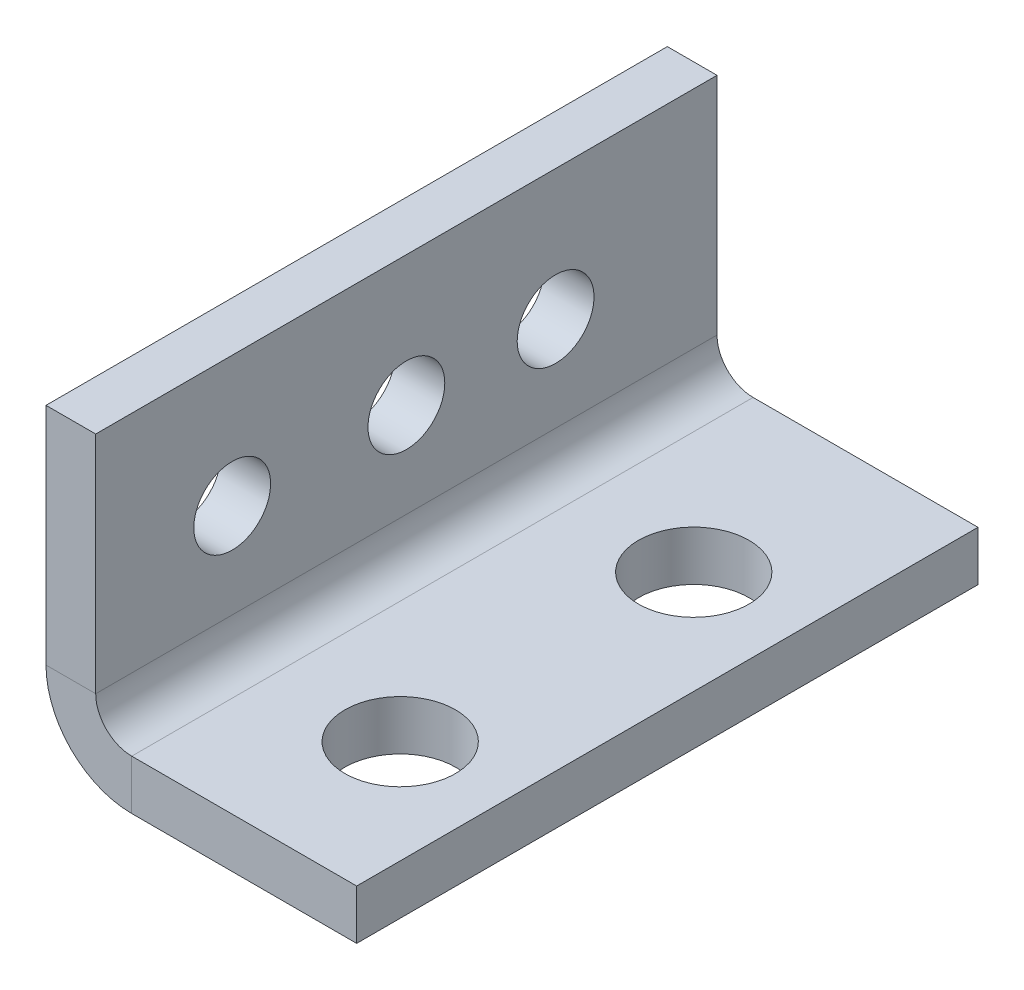
ISO-10303-21;
HEADER;
FILE_DESCRIPTION(('STEP AP214'),'2;1');
FILE_NAME('part.step','',(''),(''),'','','');
FILE_SCHEMA(('AUTOMOTIVE_DESIGN { 1 0 10303 214 1 1 1 1 }'));
ENDSEC;
DATA;
#1=APPLICATION_CONTEXT('core data for automotive mechanical design processes');
#2=APPLICATION_PROTOCOL_DEFINITION('international standard','automotive_design',2000,#1);
#3=PRODUCT_CONTEXT('',#1,'mechanical');
#4=PRODUCT('Part','Part','',(#3));
#5=PRODUCT_RELATED_PRODUCT_CATEGORY('part','',(#4));
#6=PRODUCT_DEFINITION_FORMATION('','',#4);
#7=PRODUCT_DEFINITION_CONTEXT('part definition',#1,'design');
#8=PRODUCT_DEFINITION('design','',#6,#7);
#9=PRODUCT_DEFINITION_SHAPE('','',#8);
#10=(LENGTH_UNIT() NAMED_UNIT(*) SI_UNIT(.MILLI.,.METRE.));
#11=(NAMED_UNIT(*) PLANE_ANGLE_UNIT() SI_UNIT($,.RADIAN.));
#12=(NAMED_UNIT(*) SI_UNIT($,.STERADIAN.) SOLID_ANGLE_UNIT());
#13=UNCERTAINTY_MEASURE_WITH_UNIT(LENGTH_MEASURE(1.E-05),#10,'distance_accuracy_value','');
#14=(GEOMETRIC_REPRESENTATION_CONTEXT(3) GLOBAL_UNCERTAINTY_ASSIGNED_CONTEXT((#13)) GLOBAL_UNIT_ASSIGNED_CONTEXT((#10,
#11,#12)) REPRESENTATION_CONTEXT('',''));
#15=CARTESIAN_POINT('',(0.,0.,0.));
#16=DIRECTION('',(0.,0.,1.));
#17=DIRECTION('',(1.,0.,0.));
#18=AXIS2_PLACEMENT_3D('',#15,#16,#17);
#19=CARTESIAN_POINT('',(-1.016,6.35,-12.7));
#20=DIRECTION('',(0.,0.,-1.));
#21=DIRECTION('',(-1.,0.,0.));
#22=AXIS2_PLACEMENT_3D('',#19,#20,#21);
#23=PLANE('',#22);
#24=DIRECTION('',(0.,1.,0.));
#25=VECTOR('',#24,1.);
#26=CARTESIAN_POINT('',(0.,6.35,-12.7));
#27=LINE('',#26,#25);
#28=CARTESIAN_POINT('',(0.,1.7526,-12.7));
#29=VERTEX_POINT('',#28);
#30=CARTESIAN_POINT('',(0.,6.35,-12.7));
#31=VERTEX_POINT('',#30);
#32=EDGE_CURVE('E106',#29,#31,#27,.T.);
#33=ORIENTED_EDGE('',*,*,#32,.F.);
#34=DIRECTION('',(-1.,0.,0.));
#35=VECTOR('',#34,1.);
#36=CARTESIAN_POINT('',(0.,1.7526,-12.7));
#37=LINE('',#36,#35);
#38=CARTESIAN_POINT('',(-1.016,1.7526,-12.7));
#39=VERTEX_POINT('',#38);
#40=EDGE_CURVE('E137',#29,#39,#37,.T.);
#41=ORIENTED_EDGE('',*,*,#40,.T.);
#42=DIRECTION('',(0.,1.,0.));
#43=VECTOR('',#42,1.);
#44=CARTESIAN_POINT('',(-1.016,6.35,-12.7));
#45=LINE('',#44,#43);
#46=CARTESIAN_POINT('',(-1.016,6.35,-12.7));
#47=VERTEX_POINT('',#46);
#48=EDGE_CURVE('E111',#39,#47,#45,.T.);
#49=ORIENTED_EDGE('',*,*,#48,.T.);
#50=DIRECTION('',(1.,0.,0.));
#51=VECTOR('',#50,1.);
#52=CARTESIAN_POINT('',(-1.016,6.35,-12.7));
#53=LINE('',#52,#51);
#54=EDGE_CURVE('E61',#47,#31,#53,.T.);
#55=ORIENTED_EDGE('',*,*,#54,.T.);
#56=EDGE_LOOP('',(#33,#41,#49,#55));
#57=FACE_BOUND('',#56,.T.);
#58=ADVANCED_FACE('F58',(#57),#23,.T.);
#59=CARTESIAN_POINT('',(-1.016,0.,0.));
#60=DIRECTION('',(-1.,0.,0.));
#61=DIRECTION('',(0.,0.,1.));
#62=AXIS2_PLACEMENT_3D('',#59,#60,#61);
#63=PLANE('',#62);
#64=CARTESIAN_POINT('',(-1.016,3.685,-6.35));
#65=DIRECTION('',(1.,0.,0.));
#66=DIRECTION('',(0.,0.,-1.));
#67=AXIS2_PLACEMENT_3D('',#64,#65,#66);
#68=CIRCLE('',#67,0.784999999999999);
#69=CARTESIAN_POINT('',(-1.016,3.685,-7.135));
#70=VERTEX_POINT('',#69);
#71=EDGE_CURVE('E116',#70,#70,#68,.T.);
#72=ORIENTED_EDGE('',*,*,#71,.T.);
#73=EDGE_LOOP('',(#72));
#74=FACE_BOUND('',#73,.T.);
#75=CARTESIAN_POINT('',(-1.016,3.685,-2.79));
#76=DIRECTION('',(1.,0.,0.));
#77=DIRECTION('',(0.,0.,1.));
#78=AXIS2_PLACEMENT_3D('',#75,#76,#77);
#79=CIRCLE('',#78,0.784999999999999);
#80=CARTESIAN_POINT('',(-1.016,3.685,-2.005));
#81=VERTEX_POINT('',#80);
#82=EDGE_CURVE('E123',#81,#81,#79,.T.);
#83=ORIENTED_EDGE('',*,*,#82,.T.);
#84=EDGE_LOOP('',(#83));
#85=FACE_BOUND('',#84,.T.);
#86=CARTESIAN_POINT('',(-1.016,3.685,-9.4));
#87=DIRECTION('',(1.,0.,0.));
#88=DIRECTION('',(0.,0.,1.));
#89=AXIS2_PLACEMENT_3D('',#86,#87,#88);
#90=CIRCLE('',#89,0.784999999999997);
#91=CARTESIAN_POINT('',(-1.016,3.685,-8.615));
#92=VERTEX_POINT('',#91);
#93=EDGE_CURVE('E129',#92,#92,#90,.T.);
#94=ORIENTED_EDGE('',*,*,#93,.T.);
#95=EDGE_LOOP('',(#94));
#96=FACE_BOUND('',#95,.T.);
#97=ORIENTED_EDGE('',*,*,#48,.F.);
#98=DIRECTION('',(0.,0.,-1.));
#99=VECTOR('',#98,1.);
#100=CARTESIAN_POINT('',(-1.016,1.7526,-12.7));
#101=LINE('',#100,#99);
#102=CARTESIAN_POINT('',(-1.016,1.7526,0.));
#103=VERTEX_POINT('',#102);
#104=EDGE_CURVE('E154',#39,#103,#101,.F.);
#105=ORIENTED_EDGE('',*,*,#104,.T.);
#106=DIRECTION('',(0.,-1.,0.));
#107=VECTOR('',#106,1.);
#108=CARTESIAN_POINT('',(-1.016,0.,0.));
#109=LINE('',#108,#107);
#110=CARTESIAN_POINT('',(-1.016,6.35,0.));
#111=VERTEX_POINT('',#110);
#112=EDGE_CURVE('E117',#111,#103,#109,.T.);
#113=ORIENTED_EDGE('',*,*,#112,.F.);
#114=DIRECTION('',(0.,0.,1.));
#115=VECTOR('',#114,1.);
#116=CARTESIAN_POINT('',(-1.016,6.35,0.));
#117=LINE('',#116,#115);
#118=EDGE_CURVE('E96',#47,#111,#117,.T.);
#119=ORIENTED_EDGE('',*,*,#118,.F.);
#120=EDGE_LOOP('',(#97,#105,#113,#119));
#121=FACE_BOUND('',#120,.T.);
#122=ADVANCED_FACE('F262',(#74,#85,#96,#121),#63,.T.);
#123=CARTESIAN_POINT('',(0.,0.,0.));
#124=DIRECTION('',(-1.,0.,0.));
#125=DIRECTION('',(0.,0.,1.));
#126=AXIS2_PLACEMENT_3D('',#123,#124,#125);
#127=PLANE('',#126);
#128=CARTESIAN_POINT('',(0.,3.685,-6.35));
#129=DIRECTION('',(1.,0.,0.));
#130=DIRECTION('',(0.,0.,-1.));
#131=AXIS2_PLACEMENT_3D('',#128,#129,#130);
#132=CIRCLE('',#131,0.784999999999999);
#133=CARTESIAN_POINT('',(0.,3.685,-7.135));
#134=VERTEX_POINT('',#133);
#135=EDGE_CURVE('E120',#134,#134,#132,.T.);
#136=ORIENTED_EDGE('',*,*,#135,.F.);
#137=EDGE_LOOP('',(#136));
#138=FACE_BOUND('',#137,.T.);
#139=CARTESIAN_POINT('',(0.,3.685,-2.79));
#140=DIRECTION('',(1.,0.,0.));
#141=DIRECTION('',(0.,0.,1.));
#142=AXIS2_PLACEMENT_3D('',#139,#140,#141);
#143=CIRCLE('',#142,0.784999999999999);
#144=CARTESIAN_POINT('',(0.,3.685,-2.005));
#145=VERTEX_POINT('',#144);
#146=EDGE_CURVE('E126',#145,#145,#143,.T.);
#147=ORIENTED_EDGE('',*,*,#146,.F.);
#148=EDGE_LOOP('',(#147));
#149=FACE_BOUND('',#148,.T.);
#150=CARTESIAN_POINT('',(0.,3.685,-9.4));
#151=DIRECTION('',(1.,0.,0.));
#152=DIRECTION('',(0.,0.,1.));
#153=AXIS2_PLACEMENT_3D('',#150,#151,#152);
#154=CIRCLE('',#153,0.784999999999997);
#155=CARTESIAN_POINT('',(0.,3.685,-8.615));
#156=VERTEX_POINT('',#155);
#157=EDGE_CURVE('E132',#156,#156,#154,.T.);
#158=ORIENTED_EDGE('',*,*,#157,.F.);
#159=EDGE_LOOP('',(#158));
#160=FACE_BOUND('',#159,.T.);
#161=DIRECTION('',(0.,0.,-1.));
#162=VECTOR('',#161,1.);
#163=CARTESIAN_POINT('',(0.,1.7526,-12.7));
#164=LINE('',#163,#162);
#165=CARTESIAN_POINT('',(0.,1.7526,0.));
#166=VERTEX_POINT('',#165);
#167=EDGE_CURVE('E144',#29,#166,#164,.F.);
#168=ORIENTED_EDGE('',*,*,#167,.F.);
#169=ORIENTED_EDGE('',*,*,#32,.T.);
#170=DIRECTION('',(0.,0.,1.));
#171=VECTOR('',#170,1.);
#172=CARTESIAN_POINT('',(0.,6.35,0.));
#173=LINE('',#172,#171);
#174=CARTESIAN_POINT('',(0.,6.35,0.));
#175=VERTEX_POINT('',#174);
#176=EDGE_CURVE('E94',#31,#175,#173,.T.);
#177=ORIENTED_EDGE('',*,*,#176,.T.);
#178=DIRECTION('',(0.,-1.,0.));
#179=VECTOR('',#178,1.);
#180=CARTESIAN_POINT('',(0.,0.,0.));
#181=LINE('',#180,#179);
#182=EDGE_CURVE('E103',#175,#166,#181,.T.);
#183=ORIENTED_EDGE('',*,*,#182,.T.);
#184=EDGE_LOOP('',(#168,#169,#177,#183));
#185=FACE_BOUND('',#184,.T.);
#186=ADVANCED_FACE('F101',(#138,#149,#160,#185),#127,.F.);
#187=CARTESIAN_POINT('',(-1.016,0.,0.));
#188=DIRECTION('',(0.,0.,1.));
#189=DIRECTION('',(1.,0.,0.));
#190=AXIS2_PLACEMENT_3D('',#187,#188,#189);
#191=PLANE('',#190);
#192=DIRECTION('',(-1.,0.,0.));
#193=VECTOR('',#192,1.);
#194=CARTESIAN_POINT('',(0.,1.7526,0.));
#195=LINE('',#194,#193);
#196=EDGE_CURVE('E110',#166,#103,#195,.T.);
#197=ORIENTED_EDGE('',*,*,#196,.F.);
#198=ORIENTED_EDGE('',*,*,#182,.F.);
#199=DIRECTION('',(1.,0.,0.));
#200=VECTOR('',#199,1.);
#201=CARTESIAN_POINT('',(-1.016,6.35,0.));
#202=LINE('',#201,#200);
#203=EDGE_CURVE('E13',#111,#175,#202,.T.);
#204=ORIENTED_EDGE('',*,*,#203,.F.);
#205=ORIENTED_EDGE('',*,*,#112,.T.);
#206=EDGE_LOOP('',(#197,#198,#204,#205));
#207=FACE_BOUND('',#206,.T.);
#208=ADVANCED_FACE('F109',(#207),#191,.T.);
#209=CARTESIAN_POINT('',(-1.016,6.35,0.));
#210=DIRECTION('',(0.,1.,0.));
#211=DIRECTION('',(0.,0.,1.));
#212=AXIS2_PLACEMENT_3D('',#209,#210,#211);
#213=PLANE('',#212);
#214=ORIENTED_EDGE('',*,*,#176,.F.);
#215=ORIENTED_EDGE('',*,*,#54,.F.);
#216=ORIENTED_EDGE('',*,*,#118,.T.);
#217=ORIENTED_EDGE('',*,*,#203,.T.);
#218=EDGE_LOOP('',(#214,#215,#216,#217));
#219=FACE_BOUND('',#218,.T.);
#220=ADVANCED_FACE('F92',(#219),#213,.T.);
#221=CARTESIAN_POINT('',(-1.016,3.685,-6.35));
#222=DIRECTION('',(1.,0.,0.));
#223=DIRECTION('',(0.,0.,-1.));
#224=AXIS2_PLACEMENT_3D('',#221,#222,#223);
#225=CYLINDRICAL_SURFACE('',#224,0.784999999999999);
#226=ORIENTED_EDGE('',*,*,#71,.F.);
#227=EDGE_LOOP('',(#226));
#228=FACE_BOUND('',#227,.T.);
#229=ORIENTED_EDGE('',*,*,#135,.T.);
#230=EDGE_LOOP('',(#229));
#231=FACE_BOUND('',#230,.T.);
#232=ADVANCED_FACE('F290',(#228,#231),#225,.F.);
#233=CARTESIAN_POINT('',(-1.016,3.685,-2.79));
#234=DIRECTION('',(1.,0.,0.));
#235=DIRECTION('',(0.,0.,-1.));
#236=AXIS2_PLACEMENT_3D('',#233,#234,#235);
#237=CYLINDRICAL_SURFACE('',#236,0.784999999999999);
#238=ORIENTED_EDGE('',*,*,#82,.F.);
#239=EDGE_LOOP('',(#238));
#240=FACE_BOUND('',#239,.T.);
#241=ORIENTED_EDGE('',*,*,#146,.T.);
#242=EDGE_LOOP('',(#241));
#243=FACE_BOUND('',#242,.T.);
#244=ADVANCED_FACE('F298',(#240,#243),#237,.F.);
#245=CARTESIAN_POINT('',(-1.016,3.685,-9.4));
#246=DIRECTION('',(1.,0.,0.));
#247=DIRECTION('',(0.,0.,-1.));
#248=AXIS2_PLACEMENT_3D('',#245,#246,#247);
#249=CYLINDRICAL_SURFACE('',#248,0.784999999999997);
#250=ORIENTED_EDGE('',*,*,#93,.F.);
#251=EDGE_LOOP('',(#250));
#252=FACE_BOUND('',#251,.T.);
#253=ORIENTED_EDGE('',*,*,#157,.T.);
#254=EDGE_LOOP('',(#253));
#255=FACE_BOUND('',#254,.T.);
#256=ADVANCED_FACE('F303',(#252,#255),#249,.F.);
#257=CARTESIAN_POINT('',(0.7366,1.7526,0.));
#258=DIRECTION('',(0.,0.,1.));
#259=DIRECTION('',(1.,0.,0.));
#260=AXIS2_PLACEMENT_3D('',#257,#258,#259);
#261=PLANE('',#260);
#262=DIRECTION('',(0.,1.,0.));
#263=VECTOR('',#262,1.);
#264=CARTESIAN_POINT('',(0.736599999999994,0.,0.));
#265=LINE('',#264,#263);
#266=CARTESIAN_POINT('',(0.736599999999997,1.016,0.));
#267=VERTEX_POINT('',#266);
#268=CARTESIAN_POINT('',(0.736599999999993,0.,0.));
#269=VERTEX_POINT('',#268);
#270=EDGE_CURVE('E158',#267,#269,#265,.F.);
#271=ORIENTED_EDGE('',*,*,#270,.F.);
#272=CARTESIAN_POINT('',(0.7366,1.7526,0.));
#273=DIRECTION('',(0.,0.,-1.));
#274=DIRECTION('',(-1.,0.,0.));
#275=AXIS2_PLACEMENT_3D('',#272,#273,#274);
#276=CIRCLE('',#275,0.7366);
#277=EDGE_CURVE('E148',#166,#267,#276,.F.);
#278=ORIENTED_EDGE('',*,*,#277,.F.);
#279=ORIENTED_EDGE('',*,*,#196,.T.);
#280=CARTESIAN_POINT('',(0.7366,1.7526,0.));
#281=DIRECTION('',(0.,0.,-1.));
#282=DIRECTION('',(-1.,0.,0.));
#283=AXIS2_PLACEMENT_3D('',#280,#281,#282);
#284=CIRCLE('',#283,1.7526);
#285=EDGE_CURVE('E72',#103,#269,#284,.F.);
#286=ORIENTED_EDGE('',*,*,#285,.T.);
#287=EDGE_LOOP('',(#271,#278,#279,#286));
#288=FACE_BOUND('',#287,.T.);
#289=ADVANCED_FACE('F265',(#288),#261,.T.);
#290=CARTESIAN_POINT('',(0.736600000000001,1.7526,-12.7));
#291=DIRECTION('',(0.,0.,1.));
#292=DIRECTION('',(1.,0.,0.));
#293=AXIS2_PLACEMENT_3D('',#290,#291,#292);
#294=PLANE('',#293);
#295=CARTESIAN_POINT('',(0.736600000000001,1.7526,-12.7));
#296=DIRECTION('',(0.,0.,-1.));
#297=DIRECTION('',(-1.,0.,0.));
#298=AXIS2_PLACEMENT_3D('',#295,#296,#297);
#299=CIRCLE('',#298,0.7366);
#300=CARTESIAN_POINT('',(0.736599999999998,1.016,-12.7));
#301=VERTEX_POINT('',#300);
#302=EDGE_CURVE('E141',#301,#29,#299,.T.);
#303=ORIENTED_EDGE('',*,*,#302,.F.);
#304=DIRECTION('',(0.,1.,0.));
#305=VECTOR('',#304,1.);
#306=CARTESIAN_POINT('',(0.736599999999998,1.016,-12.7));
#307=LINE('',#306,#305);
#308=CARTESIAN_POINT('',(0.736599999999994,0.,-12.7));
#309=VERTEX_POINT('',#308);
#310=EDGE_CURVE('E165',#301,#309,#307,.F.);
#311=ORIENTED_EDGE('',*,*,#310,.T.);
#312=CARTESIAN_POINT('',(0.736600000000001,1.7526,-12.7));
#313=DIRECTION('',(0.,0.,-1.));
#314=DIRECTION('',(-1.,0.,0.));
#315=AXIS2_PLACEMENT_3D('',#312,#313,#314);
#316=CIRCLE('',#315,1.7526);
#317=EDGE_CURVE('E151',#309,#39,#316,.T.);
#318=ORIENTED_EDGE('',*,*,#317,.T.);
#319=ORIENTED_EDGE('',*,*,#40,.F.);
#320=EDGE_LOOP('',(#303,#311,#318,#319));
#321=FACE_BOUND('',#320,.T.);
#322=ADVANCED_FACE('F255',(#321),#294,.F.);
#323=CARTESIAN_POINT('',(0.736600000000001,1.7526,-12.7));
#324=DIRECTION('',(0.,0.,-1.));
#325=DIRECTION('',(0.,-1.,0.));
#326=AXIS2_PLACEMENT_3D('',#323,#324,#325);
#327=CYLINDRICAL_SURFACE('',#326,1.7526);
#328=ORIENTED_EDGE('',*,*,#104,.F.);
#329=ORIENTED_EDGE('',*,*,#317,.F.);
#330=DIRECTION('',(0.,0.,-1.));
#331=VECTOR('',#330,1.);
#332=CARTESIAN_POINT('',(0.736599999999994,0.,0.));
#333=LINE('',#332,#331);
#334=EDGE_CURVE('E168',#309,#269,#333,.F.);
#335=ORIENTED_EDGE('',*,*,#334,.T.);
#336=ORIENTED_EDGE('',*,*,#285,.F.);
#337=EDGE_LOOP('',(#328,#329,#335,#336));
#338=FACE_BOUND('',#337,.T.);
#339=ADVANCED_FACE('F263',(#338),#327,.T.);
#340=CARTESIAN_POINT('',(0.736600000000001,1.7526,-12.7));
#341=DIRECTION('',(0.,0.,-1.));
#342=DIRECTION('',(0.,-1.,0.));
#343=AXIS2_PLACEMENT_3D('',#340,#341,#342);
#344=CYLINDRICAL_SURFACE('',#343,0.7366);
#345=ORIENTED_EDGE('',*,*,#167,.T.);
#346=ORIENTED_EDGE('',*,*,#277,.T.);
#347=DIRECTION('',(0.,0.,-1.));
#348=VECTOR('',#347,1.);
#349=CARTESIAN_POINT('',(0.736599999999997,1.016,0.));
#350=LINE('',#349,#348);
#351=EDGE_CURVE('E161',#267,#301,#350,.T.);
#352=ORIENTED_EDGE('',*,*,#351,.T.);
#353=ORIENTED_EDGE('',*,*,#302,.T.);
#354=EDGE_LOOP('',(#345,#346,#352,#353));
#355=FACE_BOUND('',#354,.T.);
#356=ADVANCED_FACE('F259',(#355),#344,.F.);
#357=CARTESIAN_POINT('',(0.,0.,0.));
#358=DIRECTION('',(0.,0.,-1.));
#359=DIRECTION('',(0.,1.,0.));
#360=AXIS2_PLACEMENT_3D('',#357,#358,#359);
#361=PLANE('',#360);
#362=ORIENTED_EDGE('',*,*,#270,.T.);
#363=DIRECTION('',(-1.,0.,0.));
#364=VECTOR('',#363,1.);
#365=CARTESIAN_POINT('',(0.,0.,0.));
#366=LINE('',#365,#364);
#367=CARTESIAN_POINT('',(5.334,0.,0.));
#368=VERTEX_POINT('',#367);
#369=EDGE_CURVE('E179',#368,#269,#366,.T.);
#370=ORIENTED_EDGE('',*,*,#369,.F.);
#371=DIRECTION('',(0.,1.,0.));
#372=VECTOR('',#371,1.);
#373=CARTESIAN_POINT('',(5.334,0.,0.));
#374=LINE('',#373,#372);
#375=CARTESIAN_POINT('',(5.334,1.01599999999998,0.));
#376=VERTEX_POINT('',#375);
#377=EDGE_CURVE('E188',#368,#376,#374,.T.);
#378=ORIENTED_EDGE('',*,*,#377,.T.);
#379=DIRECTION('',(1.,0.,0.));
#380=VECTOR('',#379,1.);
#381=CARTESIAN_POINT('',(0.,1.016,0.));
#382=LINE('',#381,#380);
#383=EDGE_CURVE('E170',#376,#267,#382,.F.);
#384=ORIENTED_EDGE('',*,*,#383,.T.);
#385=EDGE_LOOP('',(#362,#370,#378,#384));
#386=FACE_BOUND('',#385,.T.);
#387=ADVANCED_FACE('F267',(#386),#361,.F.);
#388=CARTESIAN_POINT('',(5.334,0.,-12.7));
#389=DIRECTION('',(0.,0.,1.));
#390=DIRECTION('',(0.,-1.,0.));
#391=AXIS2_PLACEMENT_3D('',#388,#389,#390);
#392=PLANE('',#391);
#393=ORIENTED_EDGE('',*,*,#310,.F.);
#394=DIRECTION('',(-1.,0.,0.));
#395=VECTOR('',#394,1.);
#396=CARTESIAN_POINT('',(5.334,1.01599999999998,-12.7));
#397=LINE('',#396,#395);
#398=CARTESIAN_POINT('',(5.334,1.01599999999998,-12.7));
#399=VERTEX_POINT('',#398);
#400=EDGE_CURVE('E173',#301,#399,#397,.F.);
#401=ORIENTED_EDGE('',*,*,#400,.T.);
#402=DIRECTION('',(0.,1.,0.));
#403=VECTOR('',#402,1.);
#404=CARTESIAN_POINT('',(5.334,0.,-12.7));
#405=LINE('',#404,#403);
#406=CARTESIAN_POINT('',(5.334,0.,-12.7));
#407=VERTEX_POINT('',#406);
#408=EDGE_CURVE('E145',#407,#399,#405,.T.);
#409=ORIENTED_EDGE('',*,*,#408,.F.);
#410=DIRECTION('',(1.,0.,0.));
#411=VECTOR('',#410,1.);
#412=CARTESIAN_POINT('',(0.,0.,-12.7));
#413=LINE('',#412,#411);
#414=EDGE_CURVE('E182',#309,#407,#413,.T.);
#415=ORIENTED_EDGE('',*,*,#414,.F.);
#416=EDGE_LOOP('',(#393,#401,#409,#415));
#417=FACE_BOUND('',#416,.T.);
#418=ADVANCED_FACE('F227',(#417),#392,.F.);
#419=CARTESIAN_POINT('',(0.,0.,0.));
#420=DIRECTION('',(0.,1.,0.));
#421=DIRECTION('',(-1.,0.,0.));
#422=AXIS2_PLACEMENT_3D('',#419,#420,#421);
#423=PLANE('',#422);
#424=CARTESIAN_POINT('',(3.22399999999998,0.,-9.));
#425=DIRECTION('',(0.,1.,0.));
#426=DIRECTION('',(-1.,0.,0.));
#427=AXIS2_PLACEMENT_3D('',#424,#425,#426);
#428=CIRCLE('',#427,1.13);
#429=CARTESIAN_POINT('',(2.09399999999998,0.,-9.));
#430=VERTEX_POINT('',#429);
#431=EDGE_CURVE('E198',#430,#430,#428,.F.);
#432=ORIENTED_EDGE('',*,*,#431,.F.);
#433=EDGE_LOOP('',(#432));
#434=FACE_BOUND('',#433,.T.);
#435=CARTESIAN_POINT('',(3.22399999999998,0.,-3.));
#436=DIRECTION('',(0.,1.,0.));
#437=DIRECTION('',(-1.,0.,0.));
#438=AXIS2_PLACEMENT_3D('',#435,#436,#437);
#439=CIRCLE('',#438,1.13);
#440=CARTESIAN_POINT('',(2.09399999999998,0.,-3.));
#441=VERTEX_POINT('',#440);
#442=EDGE_CURVE('E162',#441,#441,#439,.F.);
#443=ORIENTED_EDGE('',*,*,#442,.F.);
#444=EDGE_LOOP('',(#443));
#445=FACE_BOUND('',#444,.T.);
#446=ORIENTED_EDGE('',*,*,#334,.F.);
#447=ORIENTED_EDGE('',*,*,#414,.T.);
#448=DIRECTION('',(0.,0.,1.));
#449=VECTOR('',#448,1.);
#450=CARTESIAN_POINT('',(5.334,0.,0.));
#451=LINE('',#450,#449);
#452=EDGE_CURVE('E185',#407,#368,#451,.T.);
#453=ORIENTED_EDGE('',*,*,#452,.T.);
#454=ORIENTED_EDGE('',*,*,#369,.T.);
#455=EDGE_LOOP('',(#446,#447,#453,#454));
#456=FACE_BOUND('',#455,.T.);
#457=ADVANCED_FACE('F212',(#434,#445,#456),#423,.F.);
#458=CARTESIAN_POINT('',(0.,1.016,0.));
#459=DIRECTION('',(0.,1.,0.));
#460=DIRECTION('',(-1.,0.,0.));
#461=AXIS2_PLACEMENT_3D('',#458,#459,#460);
#462=PLANE('',#461);
#463=CARTESIAN_POINT('',(3.22399999999998,1.01599999999999,-9.));
#464=DIRECTION('',(0.,1.,0.));
#465=DIRECTION('',(-1.,0.,0.));
#466=AXIS2_PLACEMENT_3D('',#463,#464,#465);
#467=CIRCLE('',#466,1.13);
#468=CARTESIAN_POINT('',(2.09399999999998,1.01599999999999,-9.));
#469=VERTEX_POINT('',#468);
#470=EDGE_CURVE('E201',#469,#469,#467,.T.);
#471=ORIENTED_EDGE('',*,*,#470,.F.);
#472=EDGE_LOOP('',(#471));
#473=FACE_BOUND('',#472,.T.);
#474=CARTESIAN_POINT('',(3.22399999999998,1.01599999999999,-3.));
#475=DIRECTION('',(0.,1.,0.));
#476=DIRECTION('',(-1.,0.,0.));
#477=AXIS2_PLACEMENT_3D('',#474,#475,#476);
#478=CIRCLE('',#477,1.13);
#479=CARTESIAN_POINT('',(2.09399999999998,1.01599999999999,-3.));
#480=VERTEX_POINT('',#479);
#481=EDGE_CURVE('E195',#480,#480,#478,.T.);
#482=ORIENTED_EDGE('',*,*,#481,.F.);
#483=EDGE_LOOP('',(#482));
#484=FACE_BOUND('',#483,.T.);
#485=ORIENTED_EDGE('',*,*,#400,.F.);
#486=ORIENTED_EDGE('',*,*,#351,.F.);
#487=ORIENTED_EDGE('',*,*,#383,.F.);
#488=DIRECTION('',(0.,0.,-1.));
#489=VECTOR('',#488,1.);
#490=CARTESIAN_POINT('',(5.334,1.01599999999998,0.));
#491=LINE('',#490,#489);
#492=EDGE_CURVE('E176',#399,#376,#491,.F.);
#493=ORIENTED_EDGE('',*,*,#492,.F.);
#494=EDGE_LOOP('',(#485,#486,#487,#493));
#495=FACE_BOUND('',#494,.T.);
#496=ADVANCED_FACE('F208',(#473,#484,#495),#462,.T.);
#497=CARTESIAN_POINT('',(5.334,0.,0.));
#498=DIRECTION('',(-1.,0.,0.));
#499=DIRECTION('',(0.,-1.,0.));
#500=AXIS2_PLACEMENT_3D('',#497,#498,#499);
#501=PLANE('',#500);
#502=ORIENTED_EDGE('',*,*,#492,.T.);
#503=ORIENTED_EDGE('',*,*,#377,.F.);
#504=ORIENTED_EDGE('',*,*,#452,.F.);
#505=ORIENTED_EDGE('',*,*,#408,.T.);
#506=EDGE_LOOP('',(#502,#503,#504,#505));
#507=FACE_BOUND('',#506,.T.);
#508=ADVANCED_FACE('F211',(#507),#501,.F.);
#509=CARTESIAN_POINT('',(3.22399999999998,-0.00100000000003418,-3.));
#510=DIRECTION('',(0.,1.,0.));
#511=DIRECTION('',(-1.,0.,0.));
#512=AXIS2_PLACEMENT_3D('',#509,#510,#511);
#513=CYLINDRICAL_SURFACE('',#512,1.13);
#514=ORIENTED_EDGE('',*,*,#481,.T.);
#515=EDGE_LOOP('',(#514));
#516=FACE_BOUND('',#515,.T.);
#517=ORIENTED_EDGE('',*,*,#442,.T.);
#518=EDGE_LOOP('',(#517));
#519=FACE_BOUND('',#518,.T.);
#520=ADVANCED_FACE('F356',(#516,#519),#513,.F.);
#521=CARTESIAN_POINT('',(3.22399999999998,-0.00100000000003439,-9.));
#522=DIRECTION('',(0.,1.,0.));
#523=DIRECTION('',(-1.,0.,0.));
#524=AXIS2_PLACEMENT_3D('',#521,#522,#523);
#525=CYLINDRICAL_SURFACE('',#524,1.13);
#526=ORIENTED_EDGE('',*,*,#470,.T.);
#527=EDGE_LOOP('',(#526));
#528=FACE_BOUND('',#527,.T.);
#529=ORIENTED_EDGE('',*,*,#431,.T.);
#530=EDGE_LOOP('',(#529));
#531=FACE_BOUND('',#530,.T.);
#532=ADVANCED_FACE('F205',(#528,#531),#525,.F.);
#533=CLOSED_SHELL('',(#58,#122,#186,#208,#220,#232,#244,#256,#289,#322,#339,#356,#387,#418,#457,
#496,#508,#520,#532));
#534=MANIFOLD_SOLID_BREP('B2',#533);
#535=ADVANCED_BREP_SHAPE_REPRESENTATION('',(#18,#534),#14);
#536=SHAPE_DEFINITION_REPRESENTATION(#9,#535);
ENDSEC;
END-ISO-10303-21;
